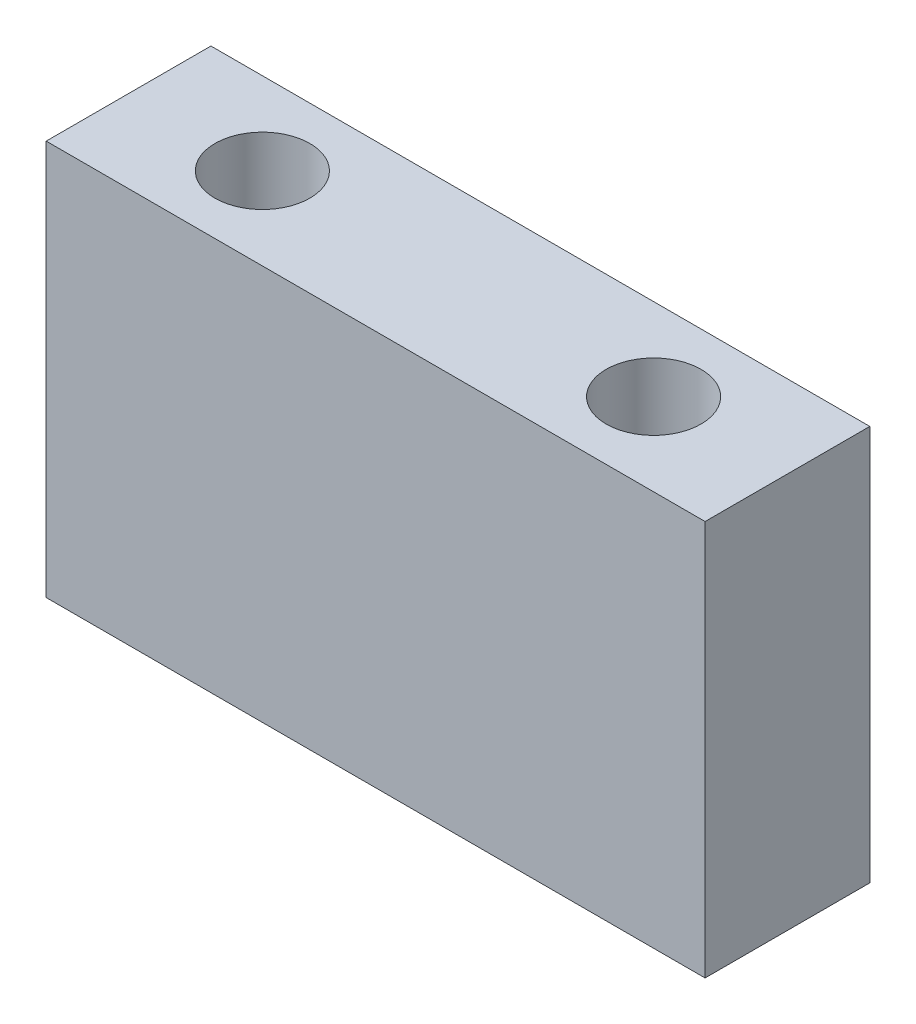
ISO-10303-21;
HEADER;
FILE_DESCRIPTION(('STEP AP214'),'2;1');
FILE_NAME('part.step','',(''),(''),'','','');
FILE_SCHEMA(('AUTOMOTIVE_DESIGN { 1 0 10303 214 1 1 1 1 }'));
ENDSEC;
DATA;
#1=APPLICATION_CONTEXT('core data for automotive mechanical design processes');
#2=APPLICATION_PROTOCOL_DEFINITION('international standard','automotive_design',2000,#1);
#3=PRODUCT_CONTEXT('',#1,'mechanical');
#4=PRODUCT('Part','Part','',(#3));
#5=PRODUCT_RELATED_PRODUCT_CATEGORY('part','',(#4));
#6=PRODUCT_DEFINITION_FORMATION('','',#4);
#7=PRODUCT_DEFINITION_CONTEXT('part definition',#1,'design');
#8=PRODUCT_DEFINITION('design','',#6,#7);
#9=PRODUCT_DEFINITION_SHAPE('','',#8);
#10=(LENGTH_UNIT() NAMED_UNIT(*) SI_UNIT(.MILLI.,.METRE.));
#11=(NAMED_UNIT(*) PLANE_ANGLE_UNIT() SI_UNIT($,.RADIAN.));
#12=(NAMED_UNIT(*) SI_UNIT($,.STERADIAN.) SOLID_ANGLE_UNIT());
#13=UNCERTAINTY_MEASURE_WITH_UNIT(LENGTH_MEASURE(1.E-05),#10,'distance_accuracy_value','');
#14=(GEOMETRIC_REPRESENTATION_CONTEXT(3) GLOBAL_UNCERTAINTY_ASSIGNED_CONTEXT((#13)) GLOBAL_UNIT_ASSIGNED_CONTEXT((#10,
#11,#12)) REPRESENTATION_CONTEXT('',''));
#15=CARTESIAN_POINT('',(0.,0.,0.));
#16=DIRECTION('',(0.,0.,1.));
#17=DIRECTION('',(1.,0.,0.));
#18=AXIS2_PLACEMENT_3D('',#15,#16,#17);
#19=CARTESIAN_POINT('',(-34.2535998730908,15.24,-12.5790056031125));
#20=DIRECTION('',(1.,0.,0.));
#21=DIRECTION('',(0.,0.,-1.));
#22=AXIS2_PLACEMENT_3D('',#19,#20,#21);
#23=PLANE('',#22);
#24=DIRECTION('',(0.,0.,1.));
#25=VECTOR('',#24,1.);
#26=CARTESIAN_POINT('',(-34.2535998730908,0.,-12.5790056031125));
#27=LINE('',#26,#25);
#28=CARTESIAN_POINT('',(-34.2535998730908,0.,-12.5790056031125));
#29=VERTEX_POINT('',#28);
#30=CARTESIAN_POINT('',(-34.2535998730908,0.,-6.22900560311248));
#31=VERTEX_POINT('',#30);
#32=EDGE_CURVE('E95',#29,#31,#27,.T.);
#33=ORIENTED_EDGE('',*,*,#32,.T.);
#34=DIRECTION('',(0.,-1.,0.));
#35=VECTOR('',#34,1.);
#36=CARTESIAN_POINT('',(-34.2535998730908,15.24,-6.22900560311248));
#37=LINE('',#36,#35);
#38=CARTESIAN_POINT('',(-34.2535998730908,15.24,-6.22900560311248));
#39=VERTEX_POINT('',#38);
#40=EDGE_CURVE('E11',#39,#31,#37,.T.);
#41=ORIENTED_EDGE('',*,*,#40,.F.);
#42=DIRECTION('',(0.,0.,1.));
#43=VECTOR('',#42,1.);
#44=CARTESIAN_POINT('',(-34.2535998730908,15.24,-12.5790056031125));
#45=LINE('',#44,#43);
#46=CARTESIAN_POINT('',(-34.2535998730908,15.24,-12.5790056031125));
#47=VERTEX_POINT('',#46);
#48=EDGE_CURVE('E83',#47,#39,#45,.T.);
#49=ORIENTED_EDGE('',*,*,#48,.F.);
#50=DIRECTION('',(0.,-1.,0.));
#51=VECTOR('',#50,1.);
#52=CARTESIAN_POINT('',(-34.2535998730908,15.24,-12.5790056031125));
#53=LINE('',#52,#51);
#54=EDGE_CURVE('E91',#47,#29,#53,.T.);
#55=ORIENTED_EDGE('',*,*,#54,.T.);
#56=EDGE_LOOP('',(#33,#41,#49,#55));
#57=FACE_BOUND('',#56,.T.);
#58=ADVANCED_FACE('F32',(#57),#23,.F.);
#59=CARTESIAN_POINT('',(-34.2535998730908,15.24,-6.22900560311248));
#60=DIRECTION('',(0.,0.,-1.));
#61=DIRECTION('',(-1.,0.,0.));
#62=AXIS2_PLACEMENT_3D('',#59,#60,#61);
#63=PLANE('',#62);
#64=DIRECTION('',(1.,0.,0.));
#65=VECTOR('',#64,1.);
#66=CARTESIAN_POINT('',(-34.2535998730908,0.,-6.22900560311248));
#67=LINE('',#66,#65);
#68=CARTESIAN_POINT('',(-8.85359987309085,0.,-6.22900560311248));
#69=VERTEX_POINT('',#68);
#70=EDGE_CURVE('E87',#31,#69,#67,.T.);
#71=ORIENTED_EDGE('',*,*,#70,.T.);
#72=DIRECTION('',(0.,-1.,0.));
#73=VECTOR('',#72,1.);
#74=CARTESIAN_POINT('',(-8.85359987309085,15.24,-6.22900560311248));
#75=LINE('',#74,#73);
#76=CARTESIAN_POINT('',(-8.85359987309085,15.24,-6.22900560311248));
#77=VERTEX_POINT('',#76);
#78=EDGE_CURVE('E40',#77,#69,#75,.T.);
#79=ORIENTED_EDGE('',*,*,#78,.F.);
#80=DIRECTION('',(1.,0.,0.));
#81=VECTOR('',#80,1.);
#82=CARTESIAN_POINT('',(-34.2535998730908,15.24,-6.22900560311248));
#83=LINE('',#82,#81);
#84=EDGE_CURVE('E78',#39,#77,#83,.T.);
#85=ORIENTED_EDGE('',*,*,#84,.F.);
#86=ORIENTED_EDGE('',*,*,#40,.T.);
#87=EDGE_LOOP('',(#71,#79,#85,#86));
#88=FACE_BOUND('',#87,.T.);
#89=ADVANCED_FACE('F86',(#88),#63,.F.);
#90=CARTESIAN_POINT('',(-8.85359987309085,15.24,-12.5790056031125));
#91=DIRECTION('',(-1.,0.,0.));
#92=DIRECTION('',(0.,0.,1.));
#93=AXIS2_PLACEMENT_3D('',#90,#91,#92);
#94=PLANE('',#93);
#95=DIRECTION('',(0.,0.,-1.));
#96=VECTOR('',#95,1.);
#97=CARTESIAN_POINT('',(-8.85359987309085,0.,-12.5790056031125));
#98=LINE('',#97,#96);
#99=CARTESIAN_POINT('',(-8.85359987309085,0.,-12.5790056031125));
#100=VERTEX_POINT('',#99);
#101=EDGE_CURVE('E65',#69,#100,#98,.T.);
#102=ORIENTED_EDGE('',*,*,#101,.T.);
#103=DIRECTION('',(0.,-1.,0.));
#104=VECTOR('',#103,1.);
#105=CARTESIAN_POINT('',(-8.85359987309085,15.24,-12.5790056031125));
#106=LINE('',#105,#104);
#107=CARTESIAN_POINT('',(-8.85359987309085,15.24,-12.5790056031125));
#108=VERTEX_POINT('',#107);
#109=EDGE_CURVE('E88',#108,#100,#106,.T.);
#110=ORIENTED_EDGE('',*,*,#109,.F.);
#111=DIRECTION('',(0.,0.,-1.));
#112=VECTOR('',#111,1.);
#113=CARTESIAN_POINT('',(-8.85359987309085,15.24,-12.5790056031125));
#114=LINE('',#113,#112);
#115=EDGE_CURVE('E81',#77,#108,#114,.T.);
#116=ORIENTED_EDGE('',*,*,#115,.F.);
#117=ORIENTED_EDGE('',*,*,#78,.T.);
#118=EDGE_LOOP('',(#102,#110,#116,#117));
#119=FACE_BOUND('',#118,.T.);
#120=ADVANCED_FACE('F89',(#119),#94,.F.);
#121=CARTESIAN_POINT('',(-34.2535998730908,15.24,-12.5790056031125));
#122=DIRECTION('',(0.,0.,1.));
#123=DIRECTION('',(1.,0.,0.));
#124=AXIS2_PLACEMENT_3D('',#121,#122,#123);
#125=PLANE('',#124);
#126=DIRECTION('',(-1.,0.,0.));
#127=VECTOR('',#126,1.);
#128=CARTESIAN_POINT('',(-34.2535998730908,0.,-12.5790056031125));
#129=LINE('',#128,#127);
#130=EDGE_CURVE('E71',#100,#29,#129,.T.);
#131=ORIENTED_EDGE('',*,*,#130,.T.);
#132=ORIENTED_EDGE('',*,*,#54,.F.);
#133=DIRECTION('',(-1.,0.,0.));
#134=VECTOR('',#133,1.);
#135=CARTESIAN_POINT('',(-34.2535998730908,15.24,-12.5790056031125));
#136=LINE('',#135,#134);
#137=EDGE_CURVE('E48',#108,#47,#136,.T.);
#138=ORIENTED_EDGE('',*,*,#137,.F.);
#139=ORIENTED_EDGE('',*,*,#109,.T.);
#140=EDGE_LOOP('',(#131,#132,#138,#139));
#141=FACE_BOUND('',#140,.T.);
#142=ADVANCED_FACE('F103',(#141),#125,.F.);
#143=CARTESIAN_POINT('',(-34.2535998730908,15.24,-6.22900560311248));
#144=DIRECTION('',(0.,1.,0.));
#145=DIRECTION('',(0.,0.,1.));
#146=AXIS2_PLACEMENT_3D('',#143,#144,#145);
#147=PLANE('',#146);
#148=CARTESIAN_POINT('',(-29.0942248730908,15.24,-9.40400560311248));
#149=DIRECTION('',(0.,1.,0.));
#150=DIRECTION('',(0.,0.,1.));
#151=AXIS2_PLACEMENT_3D('',#148,#149,#150);
#152=CIRCLE('',#151,1.8288);
#153=CARTESIAN_POINT('',(-29.0942248730908,15.24,-7.57520560311248));
#154=VERTEX_POINT('',#153);
#155=EDGE_CURVE('E117',#154,#154,#152,.T.);
#156=ORIENTED_EDGE('',*,*,#155,.F.);
#157=EDGE_LOOP('',(#156));
#158=FACE_BOUND('',#157,.T.);
#159=CARTESIAN_POINT('',(-14.0129748730909,15.24,-9.40400560311248));
#160=DIRECTION('',(0.,1.,0.));
#161=DIRECTION('',(0.,0.,1.));
#162=AXIS2_PLACEMENT_3D('',#159,#160,#161);
#163=CIRCLE('',#162,1.8288);
#164=CARTESIAN_POINT('',(-14.0129748730909,15.24,-7.57520560311248));
#165=VERTEX_POINT('',#164);
#166=EDGE_CURVE('E111',#165,#165,#163,.T.);
#167=ORIENTED_EDGE('',*,*,#166,.F.);
#168=EDGE_LOOP('',(#167));
#169=FACE_BOUND('',#168,.T.);
#170=ORIENTED_EDGE('',*,*,#48,.T.);
#171=ORIENTED_EDGE('',*,*,#84,.T.);
#172=ORIENTED_EDGE('',*,*,#115,.T.);
#173=ORIENTED_EDGE('',*,*,#137,.T.);
#174=EDGE_LOOP('',(#170,#171,#172,#173));
#175=FACE_BOUND('',#174,.T.);
#176=ADVANCED_FACE('F79',(#158,#169,#175),#147,.T.);
#177=CARTESIAN_POINT('',(-34.2535998730908,0.,-6.22900560311248));
#178=DIRECTION('',(0.,1.,0.));
#179=DIRECTION('',(0.,0.,1.));
#180=AXIS2_PLACEMENT_3D('',#177,#178,#179);
#181=PLANE('',#180);
#182=CARTESIAN_POINT('',(-29.0942248730908,0.,-9.40400560311248));
#183=DIRECTION('',(0.,1.,0.));
#184=DIRECTION('',(0.,0.,1.));
#185=AXIS2_PLACEMENT_3D('',#182,#183,#184);
#186=CIRCLE('',#185,1.8288);
#187=CARTESIAN_POINT('',(-29.0942248730908,0.,-7.57520560311248));
#188=VERTEX_POINT('',#187);
#189=EDGE_CURVE('E114',#188,#188,#186,.T.);
#190=ORIENTED_EDGE('',*,*,#189,.T.);
#191=EDGE_LOOP('',(#190));
#192=FACE_BOUND('',#191,.T.);
#193=CARTESIAN_POINT('',(-14.0129748730909,0.,-9.40400560311248));
#194=DIRECTION('',(0.,1.,0.));
#195=DIRECTION('',(0.,0.,1.));
#196=AXIS2_PLACEMENT_3D('',#193,#194,#195);
#197=CIRCLE('',#196,1.8288);
#198=CARTESIAN_POINT('',(-14.0129748730909,0.,-7.57520560311248));
#199=VERTEX_POINT('',#198);
#200=EDGE_CURVE('E98',#199,#199,#197,.T.);
#201=ORIENTED_EDGE('',*,*,#200,.T.);
#202=EDGE_LOOP('',(#201));
#203=FACE_BOUND('',#202,.T.);
#204=ORIENTED_EDGE('',*,*,#32,.F.);
#205=ORIENTED_EDGE('',*,*,#130,.F.);
#206=ORIENTED_EDGE('',*,*,#101,.F.);
#207=ORIENTED_EDGE('',*,*,#70,.F.);
#208=EDGE_LOOP('',(#204,#205,#206,#207));
#209=FACE_BOUND('',#208,.T.);
#210=ADVANCED_FACE('F106',(#192,#203,#209),#181,.F.);
#211=CARTESIAN_POINT('',(-14.0129748730909,15.24,-9.40400560311248));
#212=DIRECTION('',(0.,1.,0.));
#213=DIRECTION('',(0.,0.,1.));
#214=AXIS2_PLACEMENT_3D('',#211,#212,#213);
#215=CYLINDRICAL_SURFACE('',#214,1.8288);
#216=ORIENTED_EDGE('',*,*,#200,.F.);
#217=EDGE_LOOP('',(#216));
#218=FACE_BOUND('',#217,.T.);
#219=ORIENTED_EDGE('',*,*,#166,.T.);
#220=EDGE_LOOP('',(#219));
#221=FACE_BOUND('',#220,.T.);
#222=ADVANCED_FACE('F128',(#218,#221),#215,.F.);
#223=CARTESIAN_POINT('',(-29.0942248730908,15.24,-9.40400560311248));
#224=DIRECTION('',(0.,1.,0.));
#225=DIRECTION('',(0.,0.,1.));
#226=AXIS2_PLACEMENT_3D('',#223,#224,#225);
#227=CYLINDRICAL_SURFACE('',#226,1.8288);
#228=ORIENTED_EDGE('',*,*,#189,.F.);
#229=EDGE_LOOP('',(#228));
#230=FACE_BOUND('',#229,.T.);
#231=ORIENTED_EDGE('',*,*,#155,.T.);
#232=EDGE_LOOP('',(#231));
#233=FACE_BOUND('',#232,.T.);
#234=ADVANCED_FACE('F121',(#230,#233),#227,.F.);
#235=CLOSED_SHELL('',(#58,#89,#120,#142,#176,#210,#222,#234));
#236=MANIFOLD_SOLID_BREP('B2',#235);
#237=ADVANCED_BREP_SHAPE_REPRESENTATION('',(#18,#236),#14);
#238=SHAPE_DEFINITION_REPRESENTATION(#9,#237);
ENDSEC;
END-ISO-10303-21;
